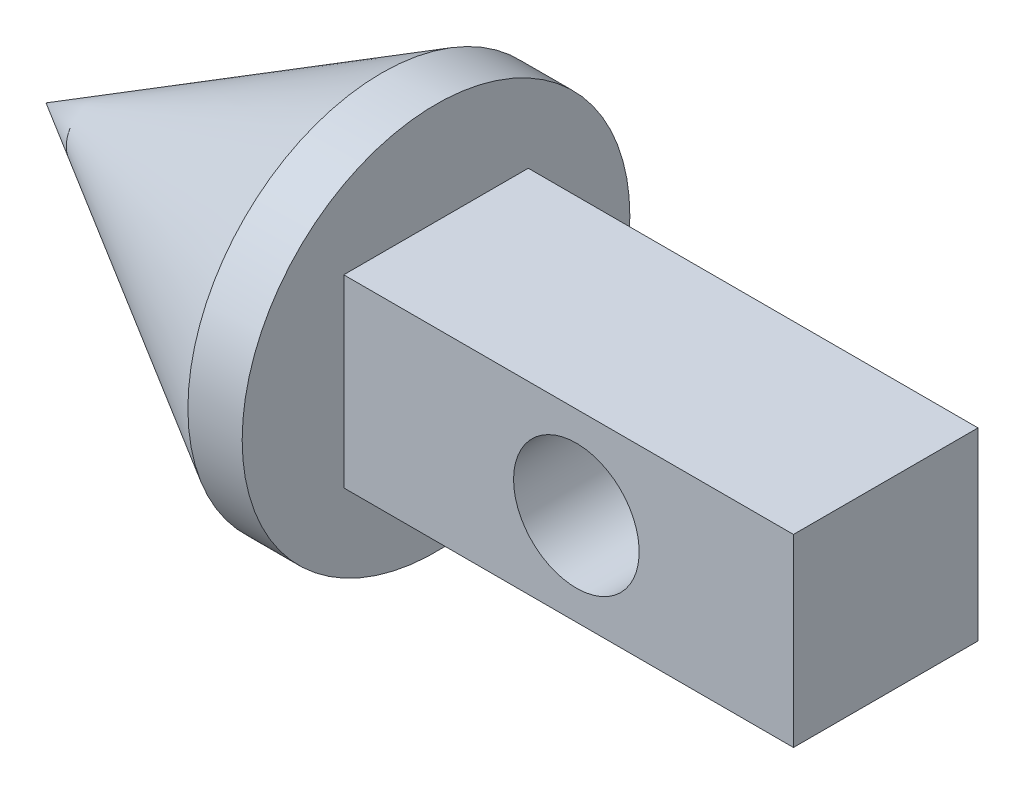
ISO-10303-21;
HEADER;
FILE_DESCRIPTION(('STEP AP214'),'2;1');
FILE_NAME('part.step','',(''),(''),'','','');
FILE_SCHEMA(('AUTOMOTIVE_DESIGN { 1 0 10303 214 1 1 1 1 }'));
ENDSEC;
DATA;
#1=APPLICATION_CONTEXT('core data for automotive mechanical design processes');
#2=APPLICATION_PROTOCOL_DEFINITION('international standard','automotive_design',2000,#1);
#3=PRODUCT_CONTEXT('',#1,'mechanical');
#4=PRODUCT('Part','Part','',(#3));
#5=PRODUCT_RELATED_PRODUCT_CATEGORY('part','',(#4));
#6=PRODUCT_DEFINITION_FORMATION('','',#4);
#7=PRODUCT_DEFINITION_CONTEXT('part definition',#1,'design');
#8=PRODUCT_DEFINITION('design','',#6,#7);
#9=PRODUCT_DEFINITION_SHAPE('','',#8);
#10=(LENGTH_UNIT() NAMED_UNIT(*) SI_UNIT(.MILLI.,.METRE.));
#11=(NAMED_UNIT(*) PLANE_ANGLE_UNIT() SI_UNIT($,.RADIAN.));
#12=(NAMED_UNIT(*) SI_UNIT($,.STERADIAN.) SOLID_ANGLE_UNIT());
#13=UNCERTAINTY_MEASURE_WITH_UNIT(LENGTH_MEASURE(1.E-05),#10,'distance_accuracy_value','');
#14=(GEOMETRIC_REPRESENTATION_CONTEXT(3) GLOBAL_UNCERTAINTY_ASSIGNED_CONTEXT((#13)) GLOBAL_UNIT_ASSIGNED_CONTEXT((#10,
#11,#12)) REPRESENTATION_CONTEXT('',''));
#15=CARTESIAN_POINT('',(0.,0.,0.));
#16=DIRECTION('',(0.,0.,1.));
#17=DIRECTION('',(1.,0.,0.));
#18=AXIS2_PLACEMENT_3D('',#15,#16,#17);
#19=CARTESIAN_POINT('',(29.,-5.95,-5.95));
#20=DIRECTION('',(0.,0.,1.));
#21=DIRECTION('',(1.,0.,0.));
#22=AXIS2_PLACEMENT_3D('',#19,#20,#21);
#23=PLANE('',#22);
#24=CARTESIAN_POINT('',(15.,0.,-5.95));
#25=DIRECTION('',(0.,0.,1.));
#26=DIRECTION('',(1.,0.,0.));
#27=AXIS2_PLACEMENT_3D('',#24,#25,#26);
#28=CIRCLE('',#27,4.05);
#29=CARTESIAN_POINT('',(19.05,0.,-5.95));
#30=VERTEX_POINT('',#29);
#31=EDGE_CURVE('E88',#30,#30,#28,.F.);
#32=ORIENTED_EDGE('',*,*,#31,.F.);
#33=EDGE_LOOP('',(#32));
#34=FACE_BOUND('',#33,.T.);
#35=DIRECTION('',(0.,1.,0.));
#36=VECTOR('',#35,1.);
#37=CARTESIAN_POINT('',(0.,-5.95,-5.95));
#38=LINE('',#37,#36);
#39=CARTESIAN_POINT('',(0.,-5.95,-5.95));
#40=VERTEX_POINT('',#39);
#41=CARTESIAN_POINT('',(0.,5.95,-5.95));
#42=VERTEX_POINT('',#41);
#43=EDGE_CURVE('E111',#40,#42,#38,.T.);
#44=ORIENTED_EDGE('',*,*,#43,.T.);
#45=DIRECTION('',(-1.,0.,0.));
#46=VECTOR('',#45,1.);
#47=CARTESIAN_POINT('',(29.,5.95,-5.95));
#48=LINE('',#47,#46);
#49=CARTESIAN_POINT('',(29.,5.95,-5.95));
#50=VERTEX_POINT('',#49);
#51=EDGE_CURVE('E11',#50,#42,#48,.T.);
#52=ORIENTED_EDGE('',*,*,#51,.F.);
#53=DIRECTION('',(0.,1.,0.));
#54=VECTOR('',#53,1.);
#55=CARTESIAN_POINT('',(29.,-5.95,-5.95));
#56=LINE('',#55,#54);
#57=CARTESIAN_POINT('',(29.,-5.95,-5.95));
#58=VERTEX_POINT('',#57);
#59=EDGE_CURVE('E98',#58,#50,#56,.T.);
#60=ORIENTED_EDGE('',*,*,#59,.F.);
#61=DIRECTION('',(-1.,0.,0.));
#62=VECTOR('',#61,1.);
#63=CARTESIAN_POINT('',(29.,-5.95,-5.95));
#64=LINE('',#63,#62);
#65=EDGE_CURVE('E110',#58,#40,#64,.T.);
#66=ORIENTED_EDGE('',*,*,#65,.T.);
#67=EDGE_LOOP('',(#44,#52,#60,#66));
#68=FACE_BOUND('',#67,.T.);
#69=ADVANCED_FACE('F39',(#34,#68),#23,.F.);
#70=CARTESIAN_POINT('',(29.,5.95,5.95));
#71=DIRECTION('',(0.,-1.,0.));
#72=DIRECTION('',(0.,0.,-1.));
#73=AXIS2_PLACEMENT_3D('',#70,#71,#72);
#74=PLANE('',#73);
#75=DIRECTION('',(0.,0.,1.));
#76=VECTOR('',#75,1.);
#77=CARTESIAN_POINT('',(0.,5.95,5.95));
#78=LINE('',#77,#76);
#79=CARTESIAN_POINT('',(0.,5.95,5.95));
#80=VERTEX_POINT('',#79);
#81=EDGE_CURVE('E115',#42,#80,#78,.T.);
#82=ORIENTED_EDGE('',*,*,#81,.T.);
#83=DIRECTION('',(-1.,0.,0.));
#84=VECTOR('',#83,1.);
#85=CARTESIAN_POINT('',(29.,5.95,5.95));
#86=LINE('',#85,#84);
#87=CARTESIAN_POINT('',(29.,5.95,5.95));
#88=VERTEX_POINT('',#87);
#89=EDGE_CURVE('E49',#88,#80,#86,.T.);
#90=ORIENTED_EDGE('',*,*,#89,.F.);
#91=DIRECTION('',(0.,0.,1.));
#92=VECTOR('',#91,1.);
#93=CARTESIAN_POINT('',(29.,5.95,5.95));
#94=LINE('',#93,#92);
#95=EDGE_CURVE('E101',#50,#88,#94,.T.);
#96=ORIENTED_EDGE('',*,*,#95,.F.);
#97=ORIENTED_EDGE('',*,*,#51,.T.);
#98=EDGE_LOOP('',(#82,#90,#96,#97));
#99=FACE_BOUND('',#98,.T.);
#100=ADVANCED_FACE('F142',(#99),#74,.F.);
#101=CARTESIAN_POINT('',(29.,-5.95,5.95));
#102=DIRECTION('',(0.,0.,-1.));
#103=DIRECTION('',(-1.,0.,0.));
#104=AXIS2_PLACEMENT_3D('',#101,#102,#103);
#105=PLANE('',#104);
#106=CARTESIAN_POINT('',(15.,0.,5.95));
#107=DIRECTION('',(0.,0.,-1.));
#108=DIRECTION('',(-1.,0.,0.));
#109=AXIS2_PLACEMENT_3D('',#106,#107,#108);
#110=CIRCLE('',#109,4.05);
#111=CARTESIAN_POINT('',(10.95,0.,5.95));
#112=VERTEX_POINT('',#111);
#113=EDGE_CURVE('E42',#112,#112,#110,.F.);
#114=ORIENTED_EDGE('',*,*,#113,.F.);
#115=EDGE_LOOP('',(#114));
#116=FACE_BOUND('',#115,.T.);
#117=DIRECTION('',(0.,-1.,0.));
#118=VECTOR('',#117,1.);
#119=CARTESIAN_POINT('',(0.,-5.95,5.95));
#120=LINE('',#119,#118);
#121=CARTESIAN_POINT('',(0.,-5.95,5.95));
#122=VERTEX_POINT('',#121);
#123=EDGE_CURVE('E119',#80,#122,#120,.T.);
#124=ORIENTED_EDGE('',*,*,#123,.T.);
#125=DIRECTION('',(-1.,0.,0.));
#126=VECTOR('',#125,1.);
#127=CARTESIAN_POINT('',(29.,-5.95,5.95));
#128=LINE('',#127,#126);
#129=CARTESIAN_POINT('',(29.,-5.95,5.95));
#130=VERTEX_POINT('',#129);
#131=EDGE_CURVE('E129',#130,#122,#128,.T.);
#132=ORIENTED_EDGE('',*,*,#131,.F.);
#133=DIRECTION('',(0.,-1.,0.));
#134=VECTOR('',#133,1.);
#135=CARTESIAN_POINT('',(29.,-5.95,5.95));
#136=LINE('',#135,#134);
#137=EDGE_CURVE('E105',#88,#130,#136,.T.);
#138=ORIENTED_EDGE('',*,*,#137,.F.);
#139=ORIENTED_EDGE('',*,*,#89,.T.);
#140=EDGE_LOOP('',(#124,#132,#138,#139));
#141=FACE_BOUND('',#140,.T.);
#142=ADVANCED_FACE('F138',(#116,#141),#105,.F.);
#143=CARTESIAN_POINT('',(29.,-5.95,5.95));
#144=DIRECTION('',(0.,1.,0.));
#145=DIRECTION('',(0.,0.,1.));
#146=AXIS2_PLACEMENT_3D('',#143,#144,#145);
#147=PLANE('',#146);
#148=DIRECTION('',(0.,0.,-1.));
#149=VECTOR('',#148,1.);
#150=CARTESIAN_POINT('',(0.,-5.95,5.95));
#151=LINE('',#150,#149);
#152=EDGE_CURVE('E102',#122,#40,#151,.T.);
#153=ORIENTED_EDGE('',*,*,#152,.T.);
#154=ORIENTED_EDGE('',*,*,#65,.F.);
#155=DIRECTION('',(0.,0.,-1.));
#156=VECTOR('',#155,1.);
#157=CARTESIAN_POINT('',(29.,-5.95,5.95));
#158=LINE('',#157,#156);
#159=EDGE_CURVE('E56',#130,#58,#158,.T.);
#160=ORIENTED_EDGE('',*,*,#159,.F.);
#161=ORIENTED_EDGE('',*,*,#131,.T.);
#162=EDGE_LOOP('',(#153,#154,#160,#161));
#163=FACE_BOUND('',#162,.T.);
#164=ADVANCED_FACE('F147',(#163),#147,.F.);
#165=CARTESIAN_POINT('',(29.,0.,0.));
#166=DIRECTION('',(-1.,0.,0.));
#167=DIRECTION('',(0.,0.,1.));
#168=AXIS2_PLACEMENT_3D('',#165,#166,#167);
#169=PLANE('',#168);
#170=ORIENTED_EDGE('',*,*,#59,.T.);
#171=ORIENTED_EDGE('',*,*,#95,.T.);
#172=ORIENTED_EDGE('',*,*,#137,.T.);
#173=ORIENTED_EDGE('',*,*,#159,.T.);
#174=EDGE_LOOP('',(#170,#171,#172,#173));
#175=FACE_BOUND('',#174,.T.);
#176=ADVANCED_FACE('F150',(#175),#169,.F.);
#177=CARTESIAN_POINT('',(15.,0.,5.950012));
#178=DIRECTION('',(0.,0.,-1.));
#179=DIRECTION('',(-1.,0.,0.));
#180=AXIS2_PLACEMENT_3D('',#177,#178,#179);
#181=CYLINDRICAL_SURFACE('',#180,4.05);
#182=ORIENTED_EDGE('',*,*,#31,.T.);
#183=EDGE_LOOP('',(#182));
#184=FACE_BOUND('',#183,.T.);
#185=ORIENTED_EDGE('',*,*,#113,.T.);
#186=EDGE_LOOP('',(#185));
#187=FACE_BOUND('',#186,.T.);
#188=ADVANCED_FACE('F152',(#184,#187),#181,.F.);
#189=CARTESIAN_POINT('',(-3.5,0.,0.));
#190=DIRECTION('',(1.,0.,0.));
#191=DIRECTION('',(0.,0.,-1.));
#192=AXIS2_PLACEMENT_3D('',#189,#190,#191);
#193=CYLINDRICAL_SURFACE('',#192,12.5);
#194=CARTESIAN_POINT('',(-3.5,0.,0.));
#195=DIRECTION('',(-1.,0.,0.));
#196=DIRECTION('',(0.,0.,1.));
#197=AXIS2_PLACEMENT_3D('',#194,#195,#196);
#198=CIRCLE('',#197,12.5);
#199=CARTESIAN_POINT('',(-3.5,0.,12.5));
#200=VERTEX_POINT('',#199);
#201=EDGE_CURVE('E85',#200,#200,#198,.T.);
#202=ORIENTED_EDGE('',*,*,#201,.F.);
#203=EDGE_LOOP('',(#202));
#204=FACE_BOUND('',#203,.T.);
#205=CARTESIAN_POINT('',(0.,0.,0.));
#206=DIRECTION('',(-1.,0.,0.));
#207=DIRECTION('',(0.,0.,1.));
#208=AXIS2_PLACEMENT_3D('',#205,#206,#207);
#209=CIRCLE('',#208,12.5);
#210=CARTESIAN_POINT('',(0.,0.,12.5));
#211=VERTEX_POINT('',#210);
#212=EDGE_CURVE('E89',#211,#211,#209,.T.);
#213=ORIENTED_EDGE('',*,*,#212,.T.);
#214=EDGE_LOOP('',(#213));
#215=FACE_BOUND('',#214,.T.);
#216=ADVANCED_FACE('F158',(#204,#215),#193,.T.);
#217=CARTESIAN_POINT('',(0.,0.,0.));
#218=DIRECTION('',(-1.,0.,0.));
#219=DIRECTION('',(0.,0.,1.));
#220=AXIS2_PLACEMENT_3D('',#217,#218,#219);
#221=PLANE('',#220);
#222=ORIENTED_EDGE('',*,*,#43,.F.);
#223=ORIENTED_EDGE('',*,*,#152,.F.);
#224=ORIENTED_EDGE('',*,*,#123,.F.);
#225=ORIENTED_EDGE('',*,*,#81,.F.);
#226=EDGE_LOOP('',(#222,#223,#224,#225));
#227=FACE_BOUND('',#226,.T.);
#228=ORIENTED_EDGE('',*,*,#212,.F.);
#229=EDGE_LOOP('',(#228));
#230=FACE_BOUND('',#229,.T.);
#231=ADVANCED_FACE('F81',(#227,#230),#221,.F.);
#232=CARTESIAN_POINT('',(-3.5,0.,0.));
#233=DIRECTION('',(1.,0.,0.));
#234=DIRECTION('',(0.,1.,0.));
#235=AXIS2_PLACEMENT_3D('',#232,#233,#234);
#236=CONICAL_SURFACE('',#235,12.5,0.523598775598293);
#237=CARTESIAN_POINT('',(-25.1506350946113,0.,0.));
#238=VERTEX_POINT('',#237);
#239=VERTEX_LOOP('',#238);
#240=FACE_BOUND('',#239,.T.);
#241=ORIENTED_EDGE('',*,*,#201,.T.);
#242=EDGE_LOOP('',(#241));
#243=FACE_BOUND('',#242,.T.);
#244=ADVANCED_FACE('F78',(#240,#243),#236,.T.);
#245=CLOSED_SHELL('',(#69,#100,#142,#164,#176,#188,#216,#231,#244));
#246=MANIFOLD_SOLID_BREP('B2',#245);
#247=ADVANCED_BREP_SHAPE_REPRESENTATION('',(#18,#246),#14);
#248=SHAPE_DEFINITION_REPRESENTATION(#9,#247);
ENDSEC;
END-ISO-10303-21;
